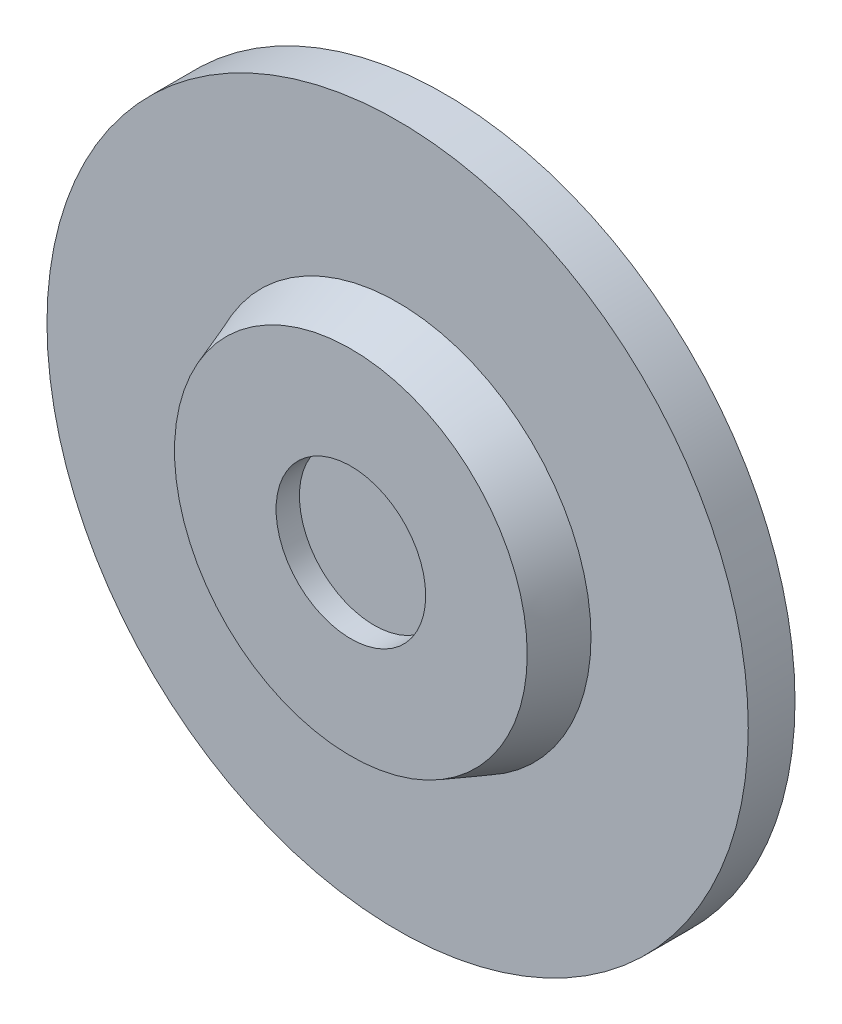
ISO-10303-21;
HEADER;
FILE_DESCRIPTION(('STEP AP214'),'2;1');
FILE_NAME('part.step','',(''),(''),'','','');
FILE_SCHEMA(('AUTOMOTIVE_DESIGN { 1 0 10303 214 1 1 1 1 }'));
ENDSEC;
DATA;
#1=APPLICATION_CONTEXT('core data for automotive mechanical design processes');
#2=APPLICATION_PROTOCOL_DEFINITION('international standard','automotive_design',2000,#1);
#3=PRODUCT_CONTEXT('',#1,'mechanical');
#4=PRODUCT('Part','Part','',(#3));
#5=PRODUCT_RELATED_PRODUCT_CATEGORY('part','',(#4));
#6=PRODUCT_DEFINITION_FORMATION('','',#4);
#7=PRODUCT_DEFINITION_CONTEXT('part definition',#1,'design');
#8=PRODUCT_DEFINITION('design','',#6,#7);
#9=PRODUCT_DEFINITION_SHAPE('','',#8);
#10=(LENGTH_UNIT() NAMED_UNIT(*) SI_UNIT(.MILLI.,.METRE.));
#11=(NAMED_UNIT(*) PLANE_ANGLE_UNIT() SI_UNIT($,.RADIAN.));
#12=(NAMED_UNIT(*) SI_UNIT($,.STERADIAN.) SOLID_ANGLE_UNIT());
#13=UNCERTAINTY_MEASURE_WITH_UNIT(LENGTH_MEASURE(1.E-05),#10,'distance_accuracy_value','');
#14=(GEOMETRIC_REPRESENTATION_CONTEXT(3) GLOBAL_UNCERTAINTY_ASSIGNED_CONTEXT((#13)) GLOBAL_UNIT_ASSIGNED_CONTEXT((#10,
#11,#12)) REPRESENTATION_CONTEXT('',''));
#15=CARTESIAN_POINT('',(0.,0.,0.));
#16=DIRECTION('',(0.,0.,1.));
#17=DIRECTION('',(1.,0.,0.));
#18=AXIS2_PLACEMENT_3D('',#15,#16,#17);
#19=CARTESIAN_POINT('',(0.,0.,1.));
#20=DIRECTION('',(0.,0.,-1.));
#21=DIRECTION('',(-1.,0.,0.));
#22=AXIS2_PLACEMENT_3D('',#19,#20,#21);
#23=CYLINDRICAL_SURFACE('',#22,7.5);
#24=CARTESIAN_POINT('',(0.,0.,1.));
#25=DIRECTION('',(0.,0.,1.));
#26=DIRECTION('',(1.,0.,0.));
#27=AXIS2_PLACEMENT_3D('',#24,#25,#26);
#28=CIRCLE('',#27,7.5);
#29=CARTESIAN_POINT('',(7.5,0.,1.));
#30=VERTEX_POINT('',#29);
#31=EDGE_CURVE('E57',#30,#30,#28,.T.);
#32=ORIENTED_EDGE('',*,*,#31,.F.);
#33=EDGE_LOOP('',(#32));
#34=FACE_BOUND('',#33,.T.);
#35=CARTESIAN_POINT('',(0.,0.,0.));
#36=DIRECTION('',(0.,0.,1.));
#37=DIRECTION('',(1.,0.,0.));
#38=AXIS2_PLACEMENT_3D('',#35,#36,#37);
#39=CIRCLE('',#38,7.5);
#40=CARTESIAN_POINT('',(7.5,0.,0.));
#41=VERTEX_POINT('',#40);
#42=EDGE_CURVE('E62',#41,#41,#39,.T.);
#43=ORIENTED_EDGE('',*,*,#42,.T.);
#44=EDGE_LOOP('',(#43));
#45=FACE_BOUND('',#44,.T.);
#46=ADVANCED_FACE('F43',(#34,#45),#23,.T.);
#47=CARTESIAN_POINT('',(0.,0.,1.));
#48=DIRECTION('',(0.,0.,1.));
#49=DIRECTION('',(1.,0.,0.));
#50=AXIS2_PLACEMENT_3D('',#47,#48,#49);
#51=PLANE('',#50);
#52=CARTESIAN_POINT('',(0.,0.,1.));
#53=DIRECTION('',(0.,0.,1.));
#54=DIRECTION('',(1.,0.,0.));
#55=AXIS2_PLACEMENT_3D('',#52,#53,#54);
#56=CIRCLE('',#55,4.13602976573379);
#57=CARTESIAN_POINT('',(4.13602976573379,0.,1.));
#58=VERTEX_POINT('',#57);
#59=EDGE_CURVE('E10',#58,#58,#56,.F.);
#60=ORIENTED_EDGE('',*,*,#59,.T.);
#61=EDGE_LOOP('',(#60));
#62=FACE_BOUND('',#61,.T.);
#63=ORIENTED_EDGE('',*,*,#31,.T.);
#64=EDGE_LOOP('',(#63));
#65=FACE_BOUND('',#64,.T.);
#66=ADVANCED_FACE('F123',(#62,#65),#51,.T.);
#67=CARTESIAN_POINT('',(0.,0.,0.));
#68=DIRECTION('',(0.,0.,1.));
#69=DIRECTION('',(1.,0.,0.));
#70=AXIS2_PLACEMENT_3D('',#67,#68,#69);
#71=PLANE('',#70);
#72=CARTESIAN_POINT('',(4.,0.,0.));
#73=DIRECTION('',(0.,0.,-1.));
#74=DIRECTION('',(-1.,0.,0.));
#75=AXIS2_PLACEMENT_3D('',#72,#73,#74);
#76=CIRCLE('',#75,1.5);
#77=CARTESIAN_POINT('',(2.5,0.,0.));
#78=VERTEX_POINT('',#77);
#79=EDGE_CURVE('E81',#78,#78,#76,.T.);
#80=ORIENTED_EDGE('',*,*,#79,.F.);
#81=EDGE_LOOP('',(#80));
#82=FACE_BOUND('',#81,.T.);
#83=CARTESIAN_POINT('',(0.,4.,0.));
#84=DIRECTION('',(0.,0.,-1.));
#85=DIRECTION('',(-1.,0.,0.));
#86=AXIS2_PLACEMENT_3D('',#83,#84,#85);
#87=CIRCLE('',#86,1.5);
#88=CARTESIAN_POINT('',(-1.5,4.,0.));
#89=VERTEX_POINT('',#88);
#90=EDGE_CURVE('E89',#89,#89,#87,.T.);
#91=ORIENTED_EDGE('',*,*,#90,.F.);
#92=EDGE_LOOP('',(#91));
#93=FACE_BOUND('',#92,.T.);
#94=CARTESIAN_POINT('',(-4.,0.,0.));
#95=DIRECTION('',(0.,0.,-1.));
#96=DIRECTION('',(-1.,0.,0.));
#97=AXIS2_PLACEMENT_3D('',#94,#95,#96);
#98=CIRCLE('',#97,1.5);
#99=CARTESIAN_POINT('',(-5.5,0.,0.));
#100=VERTEX_POINT('',#99);
#101=EDGE_CURVE('E90',#100,#100,#98,.T.);
#102=ORIENTED_EDGE('',*,*,#101,.F.);
#103=EDGE_LOOP('',(#102));
#104=FACE_BOUND('',#103,.T.);
#105=CARTESIAN_POINT('',(0.,-4.,0.));
#106=DIRECTION('',(0.,0.,-1.));
#107=DIRECTION('',(-1.,0.,0.));
#108=AXIS2_PLACEMENT_3D('',#105,#106,#107);
#109=CIRCLE('',#108,1.5);
#110=CARTESIAN_POINT('',(-1.5,-4.,0.));
#111=VERTEX_POINT('',#110);
#112=EDGE_CURVE('E105',#111,#111,#109,.T.);
#113=ORIENTED_EDGE('',*,*,#112,.F.);
#114=EDGE_LOOP('',(#113));
#115=FACE_BOUND('',#114,.T.);
#116=CARTESIAN_POINT('',(0.,0.,0.));
#117=DIRECTION('',(0.,0.,-1.));
#118=DIRECTION('',(-1.,0.,0.));
#119=AXIS2_PLACEMENT_3D('',#116,#117,#118);
#120=CIRCLE('',#119,1.5);
#121=CARTESIAN_POINT('',(-1.5,0.,0.));
#122=VERTEX_POINT('',#121);
#123=EDGE_CURVE('E77',#122,#122,#120,.T.);
#124=ORIENTED_EDGE('',*,*,#123,.F.);
#125=EDGE_LOOP('',(#124));
#126=FACE_BOUND('',#125,.T.);
#127=ORIENTED_EDGE('',*,*,#42,.F.);
#128=EDGE_LOOP('',(#127));
#129=FACE_BOUND('',#128,.T.);
#130=ADVANCED_FACE('F119',(#82,#93,#104,#115,#126,#129),#71,.F.);
#131=CARTESIAN_POINT('',(0.,0.,2.));
#132=DIRECTION('',(0.,0.,1.));
#133=DIRECTION('',(1.,0.,0.));
#134=AXIS2_PLACEMENT_3D('',#131,#132,#133);
#135=PLANE('',#134);
#136=CARTESIAN_POINT('',(0.,0.,2.));
#137=DIRECTION('',(0.,0.,1.));
#138=DIRECTION('',(1.,0.,0.));
#139=AXIS2_PLACEMENT_3D('',#136,#137,#138);
#140=CIRCLE('',#139,3.77205953146758);
#141=CARTESIAN_POINT('',(3.77205953146758,0.,2.));
#142=VERTEX_POINT('',#141);
#143=EDGE_CURVE('E52',#142,#142,#140,.T.);
#144=ORIENTED_EDGE('',*,*,#143,.T.);
#145=EDGE_LOOP('',(#144));
#146=FACE_BOUND('',#145,.T.);
#147=CARTESIAN_POINT('',(0.,0.,2.));
#148=DIRECTION('',(0.,0.,1.));
#149=DIRECTION('',(1.,0.,0.));
#150=AXIS2_PLACEMENT_3D('',#147,#148,#149);
#151=CIRCLE('',#150,1.6);
#152=CARTESIAN_POINT('',(1.6,0.,2.));
#153=VERTEX_POINT('',#152);
#154=EDGE_CURVE('E69',#153,#153,#151,.T.);
#155=ORIENTED_EDGE('',*,*,#154,.F.);
#156=EDGE_LOOP('',(#155));
#157=FACE_BOUND('',#156,.T.);
#158=ADVANCED_FACE('F122',(#146,#157),#135,.T.);
#159=CARTESIAN_POINT('',(0.,0.,1.5));
#160=DIRECTION('',(0.,0.,1.));
#161=DIRECTION('',(1.,0.,0.));
#162=AXIS2_PLACEMENT_3D('',#159,#160,#161);
#163=CYLINDRICAL_SURFACE('',#162,1.6);
#164=CARTESIAN_POINT('',(0.,0.,1.5));
#165=DIRECTION('',(0.,0.,1.));
#166=DIRECTION('',(1.,0.,0.));
#167=AXIS2_PLACEMENT_3D('',#164,#165,#166);
#168=CIRCLE('',#167,1.6);
#169=CARTESIAN_POINT('',(1.6,0.,1.5));
#170=VERTEX_POINT('',#169);
#171=EDGE_CURVE('E67',#170,#170,#168,.T.);
#172=ORIENTED_EDGE('',*,*,#171,.F.);
#173=EDGE_LOOP('',(#172));
#174=FACE_BOUND('',#173,.T.);
#175=ORIENTED_EDGE('',*,*,#154,.T.);
#176=EDGE_LOOP('',(#175));
#177=FACE_BOUND('',#176,.T.);
#178=ADVANCED_FACE('F142',(#174,#177),#163,.F.);
#179=CARTESIAN_POINT('',(0.,0.,1.5));
#180=DIRECTION('',(0.,0.,1.));
#181=DIRECTION('',(1.,0.,0.));
#182=AXIS2_PLACEMENT_3D('',#179,#180,#181);
#183=PLANE('',#182);
#184=ORIENTED_EDGE('',*,*,#171,.T.);
#185=EDGE_LOOP('',(#184));
#186=FACE_BOUND('',#185,.T.);
#187=ADVANCED_FACE('F145',(#186),#183,.T.);
#188=CARTESIAN_POINT('',(0.,0.,2.));
#189=DIRECTION('',(0.,0.,-1.));
#190=DIRECTION('',(-1.,0.,0.));
#191=AXIS2_PLACEMENT_3D('',#188,#189,#190);
#192=CONICAL_SURFACE('',#191,3.77205953146758,0.349065850398873);
#193=ORIENTED_EDGE('',*,*,#59,.F.);
#194=EDGE_LOOP('',(#193));
#195=FACE_BOUND('',#194,.T.);
#196=ORIENTED_EDGE('',*,*,#143,.F.);
#197=EDGE_LOOP('',(#196));
#198=FACE_BOUND('',#197,.T.);
#199=ADVANCED_FACE('F46',(#195,#198),#192,.T.);
#200=CARTESIAN_POINT('',(0.,0.,0.5));
#201=DIRECTION('',(0.,0.,-1.));
#202=DIRECTION('',(-1.,0.,0.));
#203=AXIS2_PLACEMENT_3D('',#200,#201,#202);
#204=CYLINDRICAL_SURFACE('',#203,1.5);
#205=CARTESIAN_POINT('',(0.,0.,0.5));
#206=DIRECTION('',(0.,0.,-1.));
#207=DIRECTION('',(-1.,0.,0.));
#208=AXIS2_PLACEMENT_3D('',#205,#206,#207);
#209=CIRCLE('',#208,1.5);
#210=CARTESIAN_POINT('',(-1.5,0.,0.5));
#211=VERTEX_POINT('',#210);
#212=EDGE_CURVE('E73',#211,#211,#209,.T.);
#213=ORIENTED_EDGE('',*,*,#212,.F.);
#214=EDGE_LOOP('',(#213));
#215=FACE_BOUND('',#214,.T.);
#216=ORIENTED_EDGE('',*,*,#123,.T.);
#217=EDGE_LOOP('',(#216));
#218=FACE_BOUND('',#217,.T.);
#219=ADVANCED_FACE('F150',(#215,#218),#204,.F.);
#220=CARTESIAN_POINT('',(0.,0.,0.5));
#221=DIRECTION('',(0.,0.,-1.));
#222=DIRECTION('',(-1.,0.,0.));
#223=AXIS2_PLACEMENT_3D('',#220,#221,#222);
#224=PLANE('',#223);
#225=ORIENTED_EDGE('',*,*,#212,.T.);
#226=EDGE_LOOP('',(#225));
#227=FACE_BOUND('',#226,.T.);
#228=ADVANCED_FACE('F153',(#227),#224,.T.);
#229=CARTESIAN_POINT('',(0.,-4.,0.5));
#230=DIRECTION('',(0.,0.,-1.));
#231=DIRECTION('',(-1.,0.,0.));
#232=AXIS2_PLACEMENT_3D('',#229,#230,#231);
#233=CYLINDRICAL_SURFACE('',#232,1.5);
#234=CARTESIAN_POINT('',(0.,-4.,0.5));
#235=DIRECTION('',(0.,0.,-1.));
#236=DIRECTION('',(-1.,0.,0.));
#237=AXIS2_PLACEMENT_3D('',#234,#235,#236);
#238=CIRCLE('',#237,1.5);
#239=CARTESIAN_POINT('',(-1.5,-4.,0.5));
#240=VERTEX_POINT('',#239);
#241=EDGE_CURVE('E101',#240,#240,#238,.T.);
#242=ORIENTED_EDGE('',*,*,#241,.F.);
#243=EDGE_LOOP('',(#242));
#244=FACE_BOUND('',#243,.T.);
#245=ORIENTED_EDGE('',*,*,#112,.T.);
#246=EDGE_LOOP('',(#245));
#247=FACE_BOUND('',#246,.T.);
#248=ADVANCED_FACE('F157',(#244,#247),#233,.F.);
#249=CARTESIAN_POINT('',(0.,-4.,0.5));
#250=DIRECTION('',(0.,0.,-1.));
#251=DIRECTION('',(-1.,0.,0.));
#252=AXIS2_PLACEMENT_3D('',#249,#250,#251);
#253=PLANE('',#252);
#254=ORIENTED_EDGE('',*,*,#241,.T.);
#255=EDGE_LOOP('',(#254));
#256=FACE_BOUND('',#255,.T.);
#257=ADVANCED_FACE('F176',(#256),#253,.T.);
#258=CARTESIAN_POINT('',(-4.,0.,0.5));
#259=DIRECTION('',(0.,0.,-1.));
#260=DIRECTION('',(-1.,0.,0.));
#261=AXIS2_PLACEMENT_3D('',#258,#259,#260);
#262=CYLINDRICAL_SURFACE('',#261,1.5);
#263=CARTESIAN_POINT('',(-4.,0.,0.5));
#264=DIRECTION('',(0.,0.,-1.));
#265=DIRECTION('',(-1.,0.,0.));
#266=AXIS2_PLACEMENT_3D('',#263,#264,#265);
#267=CIRCLE('',#266,1.5);
#268=CARTESIAN_POINT('',(-5.5,0.,0.5));
#269=VERTEX_POINT('',#268);
#270=EDGE_CURVE('E109',#269,#269,#267,.T.);
#271=ORIENTED_EDGE('',*,*,#270,.F.);
#272=EDGE_LOOP('',(#271));
#273=FACE_BOUND('',#272,.T.);
#274=ORIENTED_EDGE('',*,*,#101,.T.);
#275=EDGE_LOOP('',(#274));
#276=FACE_BOUND('',#275,.T.);
#277=ADVANCED_FACE('F117',(#273,#276),#262,.F.);
#278=CARTESIAN_POINT('',(-4.,0.,0.5));
#279=DIRECTION('',(0.,0.,-1.));
#280=DIRECTION('',(-1.,0.,0.));
#281=AXIS2_PLACEMENT_3D('',#278,#279,#280);
#282=PLANE('',#281);
#283=ORIENTED_EDGE('',*,*,#270,.T.);
#284=EDGE_LOOP('',(#283));
#285=FACE_BOUND('',#284,.T.);
#286=ADVANCED_FACE('F167',(#285),#282,.T.);
#287=CARTESIAN_POINT('',(0.,4.,0.5));
#288=DIRECTION('',(0.,0.,-1.));
#289=DIRECTION('',(-1.,0.,0.));
#290=AXIS2_PLACEMENT_3D('',#287,#288,#289);
#291=CYLINDRICAL_SURFACE('',#290,1.5);
#292=CARTESIAN_POINT('',(0.,4.,0.5));
#293=DIRECTION('',(0.,0.,-1.));
#294=DIRECTION('',(-1.,0.,0.));
#295=AXIS2_PLACEMENT_3D('',#292,#293,#294);
#296=CIRCLE('',#295,1.5);
#297=CARTESIAN_POINT('',(-1.5,4.,0.5));
#298=VERTEX_POINT('',#297);
#299=EDGE_CURVE('E85',#298,#298,#296,.T.);
#300=ORIENTED_EDGE('',*,*,#299,.F.);
#301=EDGE_LOOP('',(#300));
#302=FACE_BOUND('',#301,.T.);
#303=ORIENTED_EDGE('',*,*,#90,.T.);
#304=EDGE_LOOP('',(#303));
#305=FACE_BOUND('',#304,.T.);
#306=ADVANCED_FACE('F163',(#302,#305),#291,.F.);
#307=CARTESIAN_POINT('',(0.,4.,0.5));
#308=DIRECTION('',(0.,0.,-1.));
#309=DIRECTION('',(-1.,0.,0.));
#310=AXIS2_PLACEMENT_3D('',#307,#308,#309);
#311=PLANE('',#310);
#312=ORIENTED_EDGE('',*,*,#299,.T.);
#313=EDGE_LOOP('',(#312));
#314=FACE_BOUND('',#313,.T.);
#315=ADVANCED_FACE('F159',(#314),#311,.T.);
#316=CARTESIAN_POINT('',(4.,0.,0.5));
#317=DIRECTION('',(0.,0.,-1.));
#318=DIRECTION('',(-1.,0.,0.));
#319=AXIS2_PLACEMENT_3D('',#316,#317,#318);
#320=CYLINDRICAL_SURFACE('',#319,1.5);
#321=CARTESIAN_POINT('',(4.,0.,0.5));
#322=DIRECTION('',(0.,0.,-1.));
#323=DIRECTION('',(-1.,0.,0.));
#324=AXIS2_PLACEMENT_3D('',#321,#322,#323);
#325=CIRCLE('',#324,1.5);
#326=CARTESIAN_POINT('',(2.5,0.,0.5));
#327=VERTEX_POINT('',#326);
#328=EDGE_CURVE('E94',#327,#327,#325,.T.);
#329=ORIENTED_EDGE('',*,*,#328,.F.);
#330=EDGE_LOOP('',(#329));
#331=FACE_BOUND('',#330,.T.);
#332=ORIENTED_EDGE('',*,*,#79,.T.);
#333=EDGE_LOOP('',(#332));
#334=FACE_BOUND('',#333,.T.);
#335=ADVANCED_FACE('F162',(#331,#334),#320,.F.);
#336=CARTESIAN_POINT('',(4.,0.,0.5));
#337=DIRECTION('',(0.,0.,-1.));
#338=DIRECTION('',(-1.,0.,0.));
#339=AXIS2_PLACEMENT_3D('',#336,#337,#338);
#340=PLANE('',#339);
#341=ORIENTED_EDGE('',*,*,#328,.T.);
#342=EDGE_LOOP('',(#341));
#343=FACE_BOUND('',#342,.T.);
#344=ADVANCED_FACE('F169',(#343),#340,.T.);
#345=CLOSED_SHELL('',(#46,#66,#130,#158,#178,#187,#199,#219,#228,#248,#257,#277,#286,#306,#315,
#335,#344));
#346=MANIFOLD_SOLID_BREP('B2',#345);
#347=ADVANCED_BREP_SHAPE_REPRESENTATION('',(#18,#346),#14);
#348=SHAPE_DEFINITION_REPRESENTATION(#9,#347);
ENDSEC;
END-ISO-10303-21;
